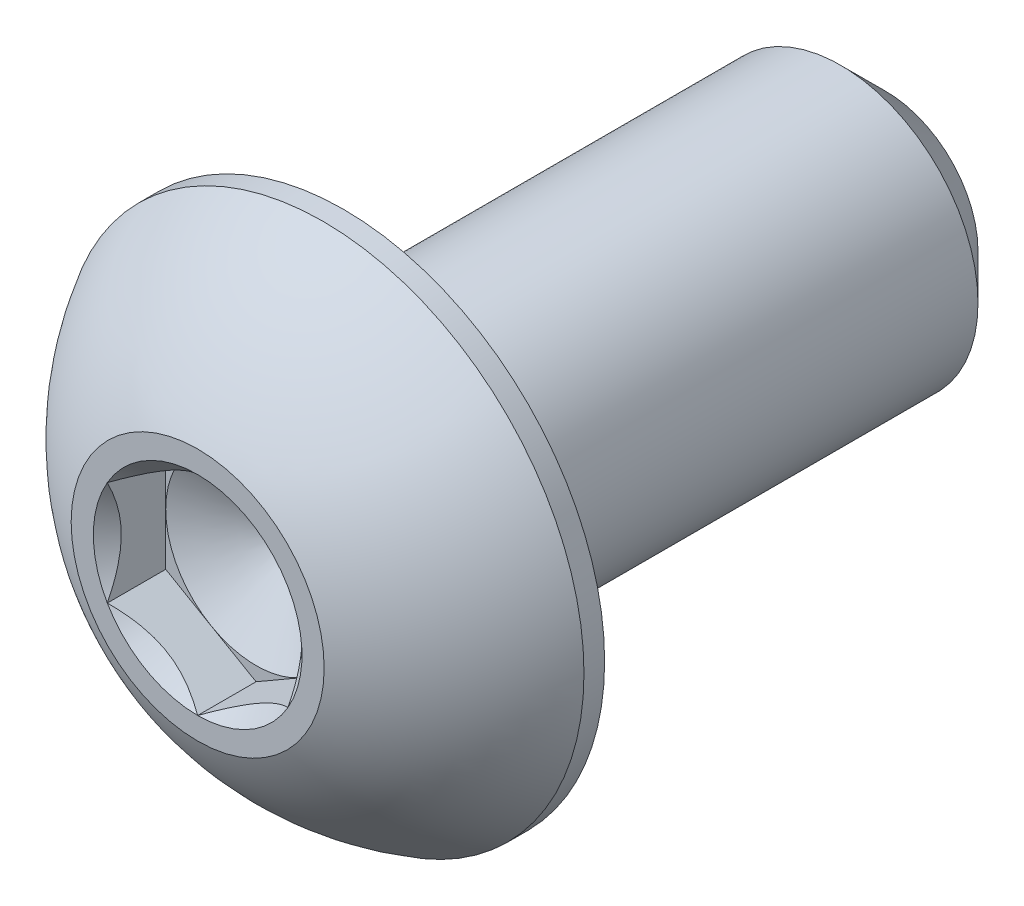
ISO-10303-21;
HEADER;
FILE_DESCRIPTION(('STEP AP214'),'2;1');
FILE_NAME('part.step','',(''),(''),'','','');
FILE_SCHEMA(('AUTOMOTIVE_DESIGN { 1 0 10303 214 1 1 1 1 }'));
ENDSEC;
DATA;
#1=APPLICATION_CONTEXT('core data for automotive mechanical design processes');
#2=APPLICATION_PROTOCOL_DEFINITION('international standard','automotive_design',2000,#1);
#3=PRODUCT_CONTEXT('',#1,'mechanical');
#4=PRODUCT('Part','Part','',(#3));
#5=PRODUCT_RELATED_PRODUCT_CATEGORY('part','',(#4));
#6=PRODUCT_DEFINITION_FORMATION('','',#4);
#7=PRODUCT_DEFINITION_CONTEXT('part definition',#1,'design');
#8=PRODUCT_DEFINITION('design','',#6,#7);
#9=PRODUCT_DEFINITION_SHAPE('','',#8);
#10=(LENGTH_UNIT() NAMED_UNIT(*) SI_UNIT(.MILLI.,.METRE.));
#11=(NAMED_UNIT(*) PLANE_ANGLE_UNIT() SI_UNIT($,.RADIAN.));
#12=(NAMED_UNIT(*) SI_UNIT($,.STERADIAN.) SOLID_ANGLE_UNIT());
#13=UNCERTAINTY_MEASURE_WITH_UNIT(LENGTH_MEASURE(1.E-05),#10,'distance_accuracy_value','');
#14=(GEOMETRIC_REPRESENTATION_CONTEXT(3) GLOBAL_UNCERTAINTY_ASSIGNED_CONTEXT((#13)) GLOBAL_UNIT_ASSIGNED_CONTEXT((#10,
#11,#12)) REPRESENTATION_CONTEXT('',''));
#15=CARTESIAN_POINT('',(0.,0.,0.));
#16=DIRECTION('',(0.,0.,1.));
#17=DIRECTION('',(1.,0.,0.));
#18=AXIS2_PLACEMENT_3D('',#15,#16,#17);
#19=CARTESIAN_POINT('',(0.,1.58750000000007,6.04519999999988));
#20=DIRECTION('',(0.,0.,-0.999999999999994));
#21=DIRECTION('',(-0.999999999999998,0.,0.));
#22=AXIS2_PLACEMENT_3D('',#19,#20,#21);
#23=PLANE('',#22);
#24=CARTESIAN_POINT('',(0.,0.,6.04519999999993));
#25=DIRECTION('',(0.,0.,0.999999999999994));
#26=DIRECTION('',(0.999999999999998,0.,0.));
#27=AXIS2_PLACEMENT_3D('',#24,#25,#26);
#28=CIRCLE('',#27,2.2225);
#29=CARTESIAN_POINT('',(2.2225,0.,6.04519999999994));
#30=VERTEX_POINT('',#29);
#31=EDGE_CURVE('E170',#30,#30,#28,.T.);
#32=ORIENTED_EDGE('',*,*,#31,.T.);
#33=EDGE_LOOP('',(#32));
#34=FACE_BOUND('',#33,.T.);
#35=CARTESIAN_POINT('',(0.,0.,6.04519999999993));
#36=DIRECTION('',(0.,0.,0.999999999999994));
#37=DIRECTION('',(0.999999999999998,0.,0.));
#38=AXIS2_PLACEMENT_3D('',#35,#36,#37);
#39=CIRCLE('',#38,1.83308710467706);
#40=CARTESIAN_POINT('',(-1.66533453693773E-13,1.83308710467717,6.04519999999985));
#41=VERTEX_POINT('',#40);
#42=CARTESIAN_POINT('',(-1.58750000000027,0.916543552338667,6.04519999999982));
#43=VERTEX_POINT('',#42);
#44=EDGE_CURVE('E124',#41,#43,#39,.T.);
#45=ORIENTED_EDGE('',*,*,#44,.F.);
#46=CARTESIAN_POINT('',(0.,0.,6.04519999999993));
#47=DIRECTION('',(0.,0.,0.999999999999994));
#48=DIRECTION('',(0.999999999999998,0.,0.));
#49=AXIS2_PLACEMENT_3D('',#46,#47,#48);
#50=CIRCLE('',#49,1.83308710467706);
#51=CARTESIAN_POINT('',(1.58749999999985,0.916543552338639,6.04519999999999));
#52=VERTEX_POINT('',#51);
#53=EDGE_CURVE('E109',#52,#41,#50,.T.);
#54=ORIENTED_EDGE('',*,*,#53,.F.);
#55=CARTESIAN_POINT('',(0.,0.,6.04519999999993));
#56=DIRECTION('',(0.,0.,0.999999999999994));
#57=DIRECTION('',(0.999999999999998,0.,0.));
#58=AXIS2_PLACEMENT_3D('',#55,#56,#57);
#59=CIRCLE('',#58,1.83308710467706);
#60=CARTESIAN_POINT('',(1.58749999999977,-0.916543552338556,6.04519999999996));
#61=VERTEX_POINT('',#60);
#62=EDGE_CURVE('E120',#61,#52,#59,.T.);
#63=ORIENTED_EDGE('',*,*,#62,.F.);
#64=CARTESIAN_POINT('',(0.,0.,6.04519999999993));
#65=DIRECTION('',(0.,0.,0.999999999999994));
#66=DIRECTION('',(0.999999999999998,0.,0.));
#67=AXIS2_PLACEMENT_3D('',#64,#65,#66);
#68=CIRCLE('',#67,1.83308710467706);
#69=CARTESIAN_POINT('',(-1.38777878078145E-13,-1.833087104677,6.04519999999999));
#70=VERTEX_POINT('',#69);
#71=EDGE_CURVE('E141',#70,#61,#68,.T.);
#72=ORIENTED_EDGE('',*,*,#71,.F.);
#73=CARTESIAN_POINT('',(0.,0.,6.04519999999993));
#74=DIRECTION('',(0.,0.,0.999999999999994));
#75=DIRECTION('',(0.999999999999998,0.,0.));
#76=AXIS2_PLACEMENT_3D('',#73,#74,#75);
#77=CIRCLE('',#76,1.83308710467706);
#78=CARTESIAN_POINT('',(-1.5875000000001,-0.9165435523385,6.0451999999999));
#79=VERTEX_POINT('',#78);
#80=EDGE_CURVE('E438',#79,#70,#77,.T.);
#81=ORIENTED_EDGE('',*,*,#80,.F.);
#82=CARTESIAN_POINT('',(0.,0.,6.04519999999993));
#83=DIRECTION('',(0.,0.,0.999999999999994));
#84=DIRECTION('',(0.999999999999998,0.,0.));
#85=AXIS2_PLACEMENT_3D('',#82,#83,#84);
#86=CIRCLE('',#85,1.83308710467706);
#87=EDGE_CURVE('E447',#43,#79,#86,.T.);
#88=ORIENTED_EDGE('',*,*,#87,.F.);
#89=EDGE_LOOP('',(#45,#54,#63,#72,#81,#88));
#90=FACE_BOUND('',#89,.T.);
#91=ADVANCED_FACE('F36',(#34,#90),#23,.F.);
#92=CARTESIAN_POINT('',(0.,0.,-6.0452));
#93=DIRECTION('',(0.,0.,0.999999999999994));
#94=DIRECTION('',(0.999999999999998,0.,0.));
#95=AXIS2_PLACEMENT_3D('',#92,#93,#94);
#96=CONICAL_SURFACE('',#95,1.61925,0.785398163397445);
#97=CARTESIAN_POINT('',(0.,0.,-5.25144999999996));
#98=DIRECTION('',(0.,0.,0.999999999999994));
#99=DIRECTION('',(0.999999999999998,0.,0.));
#100=AXIS2_PLACEMENT_3D('',#97,#98,#99);
#101=CIRCLE('',#100,2.413);
#102=CARTESIAN_POINT('',(2.41299999999999,0.,-5.25144999999996));
#103=VERTEX_POINT('',#102);
#104=EDGE_CURVE('E11',#103,#103,#101,.T.);
#105=ORIENTED_EDGE('',*,*,#104,.F.);
#106=EDGE_LOOP('',(#105));
#107=FACE_BOUND('',#106,.T.);
#108=CARTESIAN_POINT('',(0.,0.,-6.0452));
#109=DIRECTION('',(0.,0.,0.999999999999994));
#110=DIRECTION('',(0.999999999999998,0.,0.));
#111=AXIS2_PLACEMENT_3D('',#108,#109,#110);
#112=CIRCLE('',#111,1.61925);
#113=CARTESIAN_POINT('',(1.61925,0.,-6.0452));
#114=VERTEX_POINT('',#113);
#115=EDGE_CURVE('E163',#114,#114,#112,.T.);
#116=ORIENTED_EDGE('',*,*,#115,.T.);
#117=EDGE_LOOP('',(#116));
#118=FACE_BOUND('',#117,.T.);
#119=ADVANCED_FACE('F38',(#107,#118),#96,.T.);
#120=CARTESIAN_POINT('',(0.,0.,6.04519999999993));
#121=DIRECTION('',(0.,0.,0.999999999999994));
#122=DIRECTION('',(0.999999999999998,0.,0.));
#123=AXIS2_PLACEMENT_3D('',#120,#121,#122);
#124=CYLINDRICAL_SURFACE('',#123,2.413);
#125=CARTESIAN_POINT('',(0.,0.,3.47979999999996));
#126=DIRECTION('',(0.,0.,0.999999999999994));
#127=DIRECTION('',(0.999999999999998,0.,0.));
#128=AXIS2_PLACEMENT_3D('',#125,#126,#127);
#129=CIRCLE('',#128,2.413);
#130=CARTESIAN_POINT('',(2.41299999999997,0.,3.47979999999997));
#131=VERTEX_POINT('',#130);
#132=EDGE_CURVE('E44',#131,#131,#129,.T.);
#133=ORIENTED_EDGE('',*,*,#132,.F.);
#134=EDGE_LOOP('',(#133));
#135=FACE_BOUND('',#134,.T.);
#136=ORIENTED_EDGE('',*,*,#104,.T.);
#137=EDGE_LOOP('',(#136));
#138=FACE_BOUND('',#137,.T.);
#139=ADVANCED_FACE('F184',(#135,#138),#124,.T.);
#140=CARTESIAN_POINT('',(-1.94289029309402E-13,4.58470000000016,3.47979999999988));
#141=DIRECTION('',(0.,0.,0.999999999999994));
#142=DIRECTION('',(0.999999999999998,0.,0.));
#143=AXIS2_PLACEMENT_3D('',#140,#141,#142);
#144=PLANE('',#143);
#145=CARTESIAN_POINT('',(0.,0.,3.47979999999996));
#146=DIRECTION('',(0.,0.,0.999999999999994));
#147=DIRECTION('',(0.999999999999998,0.,0.));
#148=AXIS2_PLACEMENT_3D('',#145,#146,#147);
#149=CIRCLE('',#148,4.5847);
#150=CARTESIAN_POINT('',(4.58469999999996,0.,3.47979999999998));
#151=VERTEX_POINT('',#150);
#152=EDGE_CURVE('E177',#151,#151,#149,.T.);
#153=ORIENTED_EDGE('',*,*,#152,.F.);
#154=EDGE_LOOP('',(#153));
#155=FACE_BOUND('',#154,.T.);
#156=ORIENTED_EDGE('',*,*,#132,.T.);
#157=EDGE_LOOP('',(#156));
#158=FACE_BOUND('',#157,.T.);
#159=ADVANCED_FACE('F182',(#155,#158),#144,.F.);
#160=CARTESIAN_POINT('',(0.,0.,6.04519999999993));
#161=DIRECTION('',(0.,0.,0.999999999999994));
#162=DIRECTION('',(0.999999999999998,0.,0.));
#163=AXIS2_PLACEMENT_3D('',#160,#161,#162);
#164=CYLINDRICAL_SURFACE('',#163,4.5847);
#165=CARTESIAN_POINT('',(-1.94289029309402E-13,1.38777878078145E-13,3.84265714285707));
#166=DIRECTION('',(0.,0.,0.999999999999994));
#167=DIRECTION('',(0.999999999999998,0.,0.));
#168=AXIS2_PLACEMENT_3D('',#165,#166,#167);
#169=CIRCLE('',#168,4.5847);
#170=CARTESIAN_POINT('',(4.58469999999979,1.42340905728844E-13,3.84265714285709));
#171=VERTEX_POINT('',#170);
#172=EDGE_CURVE('E174',#171,#171,#169,.T.);
#173=ORIENTED_EDGE('',*,*,#172,.F.);
#174=EDGE_LOOP('',(#173));
#175=FACE_BOUND('',#174,.T.);
#176=ORIENTED_EDGE('',*,*,#152,.T.);
#177=EDGE_LOOP('',(#176));
#178=FACE_BOUND('',#177,.T.);
#179=ADVANCED_FACE('F203',(#175,#178),#164,.T.);
#180=CARTESIAN_POINT('',(0.,0.,1.29360962579431));
#181=DIRECTION('',(0.,0.,0.999999999999994));
#182=DIRECTION('',(0.,1.,0.));
#183=AXIS2_PLACEMENT_3D('',#180,#181,#182);
#184=SPHERICAL_SURFACE('',#183,5.24567606074224);
#185=ORIENTED_EDGE('',*,*,#31,.F.);
#186=EDGE_LOOP('',(#185));
#187=FACE_BOUND('',#186,.T.);
#188=ORIENTED_EDGE('',*,*,#172,.T.);
#189=EDGE_LOOP('',(#188));
#190=FACE_BOUND('',#189,.T.);
#191=ADVANCED_FACE('F195',(#187,#190),#184,.T.);
#192=CARTESIAN_POINT('',(-2.77555756156289E-13,1.61925000000017,-6.04519999999992));
#193=DIRECTION('',(0.,0.,0.999999999999994));
#194=DIRECTION('',(0.999999999999998,0.,0.));
#195=AXIS2_PLACEMENT_3D('',#192,#193,#194);
#196=PLANE('',#195);
#197=ORIENTED_EDGE('',*,*,#115,.F.);
#198=EDGE_LOOP('',(#197));
#199=FACE_BOUND('',#198,.T.);
#200=ADVANCED_FACE('F193',(#199),#196,.F.);
#201=CARTESIAN_POINT('',(1.58749999999985,0.916543552338639,6.04519999999999));
#202=DIRECTION('',(-0.499999999999998,-0.866025403784439,0.));
#203=DIRECTION('',(0.866025403784434,-0.499999999999997,0.));
#204=AXIS2_PLACEMENT_3D('',#201,#202,#203);
#205=PLANE('',#204);
#206=CARTESIAN_POINT('',(1.58769999999983,0.916428082284731,6.0453154809637));
#207=CARTESIAN_POINT('',(1.53312479190073,0.947937093371878,6.01383080837051));
#208=CARTESIAN_POINT('',(1.47763696320959,0.97997300620348,5.98419504601342));
#209=CARTESIAN_POINT('',(1.36449087915351,1.04529792829102,5.9299322600207));
#210=CARTESIAN_POINT('',(1.30682185887048,1.07859315267533,5.90533543513306));
#211=CARTESIAN_POINT('',(1.19053497812673,1.14573141457595,5.86320036427247));
#212=CARTESIAN_POINT('',(1.1319467447439,1.17955734689087,5.84555619272971));
#213=CARTESIAN_POINT('',(1.01348022674539,1.24795402294727,5.81837147008489));
#214=CARTESIAN_POINT('',(0.953605562983705,1.28252267618772,5.80881062069505));
#215=CARTESIAN_POINT('',(0.850418771876363,1.34209759781036,5.80018441310398));
#216=CARTESIAN_POINT('',(0.807240015952097,1.3670268641665,5.79890719280953));
#217=CARTESIAN_POINT('',(0.720953038535216,1.41684467380569,5.80105705581466));
#218=CARTESIAN_POINT('',(0.677844847078434,1.44173319974755,5.80448578854931));
#219=CARTESIAN_POINT('',(0.592046335001865,1.49126899379103,5.81585099443333));
#220=CARTESIAN_POINT('',(0.549356408925249,1.51591603410305,5.82379137180163));
#221=CARTESIAN_POINT('',(0.464693063478203,1.56479643938738,5.84374841445109));
#222=CARTESIAN_POINT('',(0.422719959754912,1.58902962212073,5.85576682920866));
#223=CARTESIAN_POINT('',(0.315211458113404,1.65109968448361,5.89144689724721));
#224=CARTESIAN_POINT('',(0.25034277170876,1.68855163804135,5.91779857230313));
#225=CARTESIAN_POINT('',(0.154961599380803,1.74361998356052,5.96228353685173));
#226=CARTESIAN_POINT('',(0.12353069953604,1.76176662204677,5.97791285780117));
#227=CARTESIAN_POINT('',(0.0612469855695099,1.79772614107147,6.0105984878611));
#228=CARTESIAN_POINT('',(0.0303939039604356,1.81553917604381,6.02765411565692));
#229=CARTESIAN_POINT('',(-0.000200000000172285,1.83320257473105,6.04531548096356));
#230=B_SPLINE_CURVE_WITH_KNOTS('',3,(#206,#207,#208,#209,#210,#211,#212,#213,#214,#215,#216,
#217,#218,#219,#220,#221,#222,#223,#224,#225,#226,#227,#228,#229),.UNSPECIFIED.,.F.,.F.,(4,2,2,
2,2,2,2,2,2,2,2,4),(0.,0.211482650810855,0.42419787080734,0.633533884524897,0.842342653263452,
0.991755553727228,1.14122083674212,1.29081565918883,1.44047473906441,1.67818780869723,
1.79671410024897,1.91518409436633),.UNSPECIFIED.);
#231=EDGE_CURVE('E106',#52,#41,#230,.T.);
#232=ORIENTED_EDGE('',*,*,#231,.T.);
#233=DIRECTION('',(0.,0.,-0.999999999999994));
#234=VECTOR('',#233,1.);
#235=CARTESIAN_POINT('',(-1.66533453693773E-13,1.83308710467717,6.04519999999985));
#236=LINE('',#235,#234);
#237=CARTESIAN_POINT('',(-1.94289029309402E-13,1.83308710467721,5.01903999999977));
#238=VERTEX_POINT('',#237);
#239=EDGE_CURVE('E161',#41,#238,#236,.T.);
#240=ORIENTED_EDGE('',*,*,#239,.T.);
#241=DIRECTION('',(-0.866025403784434,0.499999999999997,0.));
#242=VECTOR('',#241,1.);
#243=CARTESIAN_POINT('',(1.58749999999974,0.916543552338653,5.01903999999991));
#244=LINE('',#243,#242);
#245=CARTESIAN_POINT('',(0.793749999999843,1.37481532850799,5.01903999999993));
#246=VERTEX_POINT('',#245);
#247=EDGE_CURVE('E474',#246,#238,#244,.T.);
#248=ORIENTED_EDGE('',*,*,#247,.F.);
#249=CARTESIAN_POINT('',(1.58749999999974,0.916543552338653,5.01903999999991));
#250=VERTEX_POINT('',#249);
#251=EDGE_CURVE('E51',#250,#246,#244,.T.);
#252=ORIENTED_EDGE('',*,*,#251,.F.);
#253=DIRECTION('',(0.,0.,-0.999999999999994));
#254=VECTOR('',#253,1.);
#255=CARTESIAN_POINT('',(1.58749999999985,0.916543552338639,6.04519999999999));
#256=LINE('',#255,#254);
#257=EDGE_CURVE('E137',#52,#250,#256,.T.);
#258=ORIENTED_EDGE('',*,*,#257,.F.);
#259=EDGE_LOOP('',(#232,#240,#248,#252,#258));
#260=FACE_BOUND('',#259,.T.);
#261=ADVANCED_FACE('F143',(#260),#205,.T.);
#262=CARTESIAN_POINT('',(-1.66533453693773E-13,1.83308710467717,6.04519999999985));
#263=DIRECTION('',(0.499999999999997,-0.866025403784438,0.));
#264=DIRECTION('',(0.866025403784437,0.500000000000001,0.));
#265=AXIS2_PLACEMENT_3D('',#262,#263,#264);
#266=PLANE('',#265);
#267=CARTESIAN_POINT('',(0.000199999999922484,1.83320257473099,6.04531548096367));
#268=CARTESIAN_POINT('',(-0.0543752080992611,1.8016935636439,6.01383080837063));
#269=CARTESIAN_POINT('',(-0.109863036790426,1.76965765081232,5.98419504601359));
#270=CARTESIAN_POINT('',(-0.223009120846511,1.70433272872479,5.9299322600209));
#271=CARTESIAN_POINT('',(-0.280678141129537,1.67103750434047,5.90533543513324));
#272=CARTESIAN_POINT('',(-0.39696502187329,1.60389924243987,5.86320036427266));
#273=CARTESIAN_POINT('',(-0.455553255256144,1.57007331012497,5.84555619272994));
#274=CARTESIAN_POINT('',(-0.5740197732546,1.5016766340685,5.81837147008502));
#275=CARTESIAN_POINT('',(-0.633894437016204,1.46710798082797,5.80881062069502));
#276=CARTESIAN_POINT('',(-0.737081228123542,1.40753305920538,5.800184413104));
#277=CARTESIAN_POINT('',(-0.780259984047845,1.38260379284931,5.79890719280966));
#278=CARTESIAN_POINT('',(-0.866546961464744,1.33278598321018,5.80105705581485));
#279=CARTESIAN_POINT('',(-0.909655152921509,1.3078974572683,5.80448578854946));
#280=CARTESIAN_POINT('',(-0.995453664998067,1.25836166322483,5.81585099443346));
#281=CARTESIAN_POINT('',(-1.03814359107469,1.23371462291284,5.82379137180178));
#282=CARTESIAN_POINT('',(-1.12280693652171,1.18483421762845,5.84374841445118));
#283=CARTESIAN_POINT('',(-1.16478004024496,1.16060103489501,5.85576682920868));
#284=CARTESIAN_POINT('',(-1.27228854188645,1.09853097253207,5.89144689724718));
#285=CARTESIAN_POINT('',(-1.33715722829116,1.06107901897447,5.91779857230319));
#286=CARTESIAN_POINT('',(-1.43253840061916,1.00601067345534,5.96228353685182));
#287=CARTESIAN_POINT('',(-1.46396930046393,0.987864034969089,5.97791285780125));
#288=CARTESIAN_POINT('',(-1.52625301443046,0.951904515944341,6.01059848786118));
#289=CARTESIAN_POINT('',(-1.55710609603952,0.934091480971975,6.027654115657));
#290=CARTESIAN_POINT('',(-1.58770000000011,0.916428082284704,6.04531548096367));
#291=B_SPLINE_CURVE_WITH_KNOTS('',3,(#267,#268,#269,#270,#271,#272,#273,#274,#275,#276,#277,
#278,#279,#280,#281,#282,#283,#284,#285,#286,#287,#288,#289,#290),.UNSPECIFIED.,.F.,.F.,(4,2,2,
2,2,2,2,2,2,2,2,4),(0.,0.211482650810803,0.424197870807304,0.633533884524863,0.842342653263385,
0.991755553727131,1.14122083674201,1.2908156591887,1.44047473906426,1.67818780869713,
1.79671410024889,1.91518409436627),.UNSPECIFIED.);
#292=EDGE_CURVE('E462',#41,#43,#291,.T.);
#293=ORIENTED_EDGE('',*,*,#292,.T.);
#294=DIRECTION('',(0.,0.,-0.999999999999994));
#295=VECTOR('',#294,1.);
#296=CARTESIAN_POINT('',(-1.58750000000027,0.916543552338667,6.04519999999982));
#297=LINE('',#296,#295);
#298=CARTESIAN_POINT('',(-1.58750000000024,0.916543552338778,5.01903999999982));
#299=VERTEX_POINT('',#298);
#300=EDGE_CURVE('E158',#43,#299,#297,.T.);
#301=ORIENTED_EDGE('',*,*,#300,.T.);
#302=DIRECTION('',(-0.866025403784437,-0.500000000000001,0.));
#303=VECTOR('',#302,1.);
#304=CARTESIAN_POINT('',(-1.94289029309402E-13,1.83308710467721,5.01903999999977));
#305=LINE('',#304,#303);
#306=CARTESIAN_POINT('',(-0.793750000000426,1.37481532850799,5.01903999999993));
#307=VERTEX_POINT('',#306);
#308=EDGE_CURVE('E476',#307,#299,#305,.T.);
#309=ORIENTED_EDGE('',*,*,#308,.F.);
#310=EDGE_CURVE('E477',#238,#307,#305,.T.);
#311=ORIENTED_EDGE('',*,*,#310,.F.);
#312=ORIENTED_EDGE('',*,*,#239,.F.);
#313=EDGE_LOOP('',(#293,#301,#309,#311,#312));
#314=FACE_BOUND('',#313,.T.);
#315=ADVANCED_FACE('F201',(#314),#266,.T.);
#316=CARTESIAN_POINT('',(-1.58750000000027,0.916543552338667,6.04519999999982));
#317=DIRECTION('',(0.999999999999998,0.,0.));
#318=DIRECTION('',(0.,0.,-0.999999999999994));
#319=AXIS2_PLACEMENT_3D('',#316,#317,#318);
#320=PLANE('',#319);
#321=CARTESIAN_POINT('',(-1.5875000000003,-1.80645042689193,6.61698698658385));
#322=CARTESIAN_POINT('',(-1.58750000000028,-1.76236619946985,6.58387765189207));
#323=CARTESIAN_POINT('',(-1.58750000000027,-1.71803401722439,6.55109936728736));
#324=CARTESIAN_POINT('',(-1.58750000000027,-1.62877387436161,6.48634092729781));
#325=CARTESIAN_POINT('',(-1.58750000000027,-1.58384576476267,6.45436097748321));
#326=CARTESIAN_POINT('',(-1.58750000000027,-1.44736053267693,6.35936696154791));
#327=CARTESIAN_POINT('',(-1.58750000000025,-1.3547728804757,6.29780882424475));
#328=CARTESIAN_POINT('',(-1.58750000000028,-1.16075761948649,6.17715751972012));
#329=CARTESIAN_POINT('',(-1.58750000000033,-1.05912459725123,6.11839084409815));
#330=CARTESIAN_POINT('',(-1.5875000000002,-0.850810108093185,6.01103067812025));
#331=CARTESIAN_POINT('',(-1.58750000000002,-0.744147188151308,5.96240292542404));
#332=CARTESIAN_POINT('',(-1.58750000000014,-0.583837187922957,5.90291807950616));
#333=CARTESIAN_POINT('',(-1.58750000000023,-0.532518160842241,5.88581011476269));
#334=CARTESIAN_POINT('',(-1.5875000000003,-0.428659985513726,5.8557170530759));
#335=CARTESIAN_POINT('',(-1.58750000000028,-0.376120751676435,5.84273224628803));
#336=CARTESIAN_POINT('',(-1.58750000000026,-0.27100369810843,5.82177039746287));
#337=CARTESIAN_POINT('',(-1.58750000000026,-0.218442994151775,5.81370885122087));
#338=CARTESIAN_POINT('',(-1.58750000000027,-0.112783135871231,5.80274746810404));
#339=CARTESIAN_POINT('',(-1.58750000000027,-0.0596840710481443,5.79984678695649));
#340=CARTESIAN_POINT('',(-1.58750000000027,0.0447055832561276,5.79941381931856));
#341=CARTESIAN_POINT('',(-1.58750000000027,0.0959954901562707,5.80170012793693));
#342=CARTESIAN_POINT('',(-1.58750000000027,0.198125185705364,5.81111970580175));
#343=CARTESIAN_POINT('',(-1.58750000000027,0.248964929488588,5.81825345278285));
#344=CARTESIAN_POINT('',(-1.58750000000027,0.350686556652219,5.8371031096996));
#345=CARTESIAN_POINT('',(-1.58750000000027,0.401553911407961,5.84889626149526));
#346=CARTESIAN_POINT('',(-1.58750000000027,0.502179810539587,5.87644443755652));
#347=CARTESIAN_POINT('',(-1.58750000000027,0.551938454553221,5.89219910423221));
#348=CARTESIAN_POINT('',(-1.58750000000027,0.709597941546914,5.94801737605607));
#349=CARTESIAN_POINT('',(-1.58750000000027,0.815228306930224,5.99447915633843));
#350=CARTESIAN_POINT('',(-1.58750000000027,1.0215173517048,6.09775145508559));
#351=CARTESIAN_POINT('',(-1.58750000000027,1.12215634479545,6.15459935808182));
#352=CARTESIAN_POINT('',(-1.58750000000027,1.31447644029513,6.27184912470752));
#353=CARTESIAN_POINT('',(-1.58750000000026,1.40635401847366,6.33193268451356));
#354=CARTESIAN_POINT('',(-1.58750000000027,1.54171769329402,6.42480190804494));
#355=CARTESIAN_POINT('',(-1.58750000000028,1.58625419266996,6.4560831278699));
#356=CARTESIAN_POINT('',(-1.58750000000026,1.67471932537725,6.51946920360782));
#357=CARTESIAN_POINT('',(-1.58750000000023,1.71864812234289,6.55157383088697));
#358=CARTESIAN_POINT('',(-1.58750000000016,1.76232404534835,6.58401978447597));
#359=B_SPLINE_CURVE_WITH_KNOTS('',3,(#321,#322,#323,#324,#325,#326,#327,#328,#329,#330,#331,
#332,#333,#334,#335,#336,#337,#338,#339,#340,#341,#342,#343,#344,#345,#346,#347,#348,#349,#350,
#351,#352,#353,#354,#355,#356,#357,#358),.UNSPECIFIED.,.F.,.F.,(4,2,2,2,2,2,2,2,2,2,2,2,2,2,2,2,
2,2,4),(0.,0.165394720611731,0.330831599805528,0.664230904656233,1.0161364276987,
1.36683276443435,1.52898157466773,1.69114179313286,1.85043410106579,2.00970034776328,
2.16348276168536,2.31728033368469,2.47374234648066,2.63019024115089,2.97536284656872,
3.32180328575191,3.65097853196632,3.8142455159314,3.97746764647546),.UNSPECIFIED.);
#360=EDGE_CURVE('E455',#43,#79,#359,.F.);
#361=ORIENTED_EDGE('',*,*,#360,.T.);
#362=DIRECTION('',(0.,0.,-0.999999999999994));
#363=VECTOR('',#362,1.);
#364=CARTESIAN_POINT('',(-1.5875000000001,-0.9165435523385,6.0451999999999));
#365=LINE('',#364,#363);
#366=CARTESIAN_POINT('',(-1.5875000000001,-0.916543552338486,5.01903999999999));
#367=VERTEX_POINT('',#366);
#368=EDGE_CURVE('E155',#79,#367,#365,.T.);
#369=ORIENTED_EDGE('',*,*,#368,.T.);
#370=DIRECTION('',(0.,-1.,0.));
#371=VECTOR('',#370,1.);
#372=CARTESIAN_POINT('',(-1.58750000000024,0.916543552338778,5.01903999999982));
#373=LINE('',#372,#371);
#374=CARTESIAN_POINT('',(-1.58750000000041,1.94289029309402E-13,5.01903999999991));
#375=VERTEX_POINT('',#374);
#376=EDGE_CURVE('E480',#375,#367,#373,.T.);
#377=ORIENTED_EDGE('',*,*,#376,.F.);
#378=EDGE_CURVE('E481',#299,#375,#373,.T.);
#379=ORIENTED_EDGE('',*,*,#378,.F.);
#380=ORIENTED_EDGE('',*,*,#300,.F.);
#381=EDGE_LOOP('',(#361,#369,#377,#379,#380));
#382=FACE_BOUND('',#381,.T.);
#383=ADVANCED_FACE('F254',(#382),#320,.T.);
#384=CARTESIAN_POINT('',(-1.5875000000001,-0.9165435523385,6.0451999999999));
#385=DIRECTION('',(0.499999999999998,0.866025403784439,0.));
#386=DIRECTION('',(-0.866025403784435,0.499999999999998,0.));
#387=AXIS2_PLACEMENT_3D('',#384,#385,#386);
#388=PLANE('',#387);
#389=CARTESIAN_POINT('',(-1.5877000000003,-0.916428082284523,6.04531548096356));
#390=CARTESIAN_POINT('',(-1.53312479190112,-0.947937093371687,6.01383080837059));
#391=CARTESIAN_POINT('',(-1.47763696320995,-0.979973006203285,5.98419504601358));
#392=CARTESIAN_POINT('',(-1.36449087915387,-1.04529792829081,5.9299322600209));
#393=CARTESIAN_POINT('',(-1.30682185887085,-1.07859315267511,5.90533543513323));
#394=CARTESIAN_POINT('',(-1.19053497812712,-1.14573141457574,5.8632003642726));
#395=CARTESIAN_POINT('',(-1.13194674474428,-1.17955734689068,5.84555619272982));
#396=CARTESIAN_POINT('',(-1.01348022674573,-1.24795402294706,5.81837147008495));
#397=CARTESIAN_POINT('',(-0.953605562984013,-1.28252267618746,5.80881062069506));
#398=CARTESIAN_POINT('',(-0.850418771876682,-1.34209759781011,5.80018441310398));
#399=CARTESIAN_POINT('',(-0.807240015952446,-1.36702686416629,5.79890719280953));
#400=CARTESIAN_POINT('',(-0.720953038535594,-1.4168446738055,5.80105705581464));
#401=CARTESIAN_POINT('',(-0.677844847078811,-1.44173319974734,5.80448578854927));
#402=CARTESIAN_POINT('',(-0.592046335002256,-1.4912689937908,5.81585099443327));
#403=CARTESIAN_POINT('',(-0.549356408925655,-1.51591603410282,5.82379137180157));
#404=CARTESIAN_POINT('',(-0.464693063478618,-1.56479643938715,5.84374841445096));
#405=CARTESIAN_POINT('',(-0.422719959755321,-1.58902962212048,5.85576682920846));
#406=CARTESIAN_POINT('',(-0.31521145811382,-1.65109968448336,5.89144689724695));
#407=CARTESIAN_POINT('',(-0.250342771709208,-1.68855163804109,5.91779857230293));
#408=CARTESIAN_POINT('',(-0.154961599381251,-1.74361998356027,5.96228353685151));
#409=CARTESIAN_POINT('',(-0.123530699536477,-1.76176662204652,5.97791285780092));
#410=CARTESIAN_POINT('',(-0.0612469855699508,-1.79772614107122,6.01059848786088));
#411=CARTESIAN_POINT('',(-0.0303939039608903,-1.81553917604353,6.02765411565675));
#412=CARTESIAN_POINT('',(0.000199999999672684,-1.83320257473071,6.04531548096353));
#413=B_SPLINE_CURVE_WITH_KNOTS('',3,(#389,#390,#391,#392,#393,#394,#395,#396,#397,#398,#399,
#400,#401,#402,#403,#404,#405,#406,#407,#408,#409,#410,#411,#412),.UNSPECIFIED.,.F.,.F.,(4,2,2,
2,2,2,2,2,2,2,2,4),(0.,0.211482650810808,0.424197870807276,0.633533884524882,0.842342653263472,
0.99175555372722,1.14122083674209,1.29081565918876,1.4404747390643,1.67818780869709,
1.79671410024883,1.9151840943662),.UNSPECIFIED.);
#414=EDGE_CURVE('E440',#79,#70,#413,.T.);
#415=ORIENTED_EDGE('',*,*,#414,.T.);
#416=DIRECTION('',(0.,0.,-0.999999999999994));
#417=VECTOR('',#416,1.);
#418=CARTESIAN_POINT('',(-1.38777878078145E-13,-1.833087104677,6.04519999999999));
#419=LINE('',#418,#417);
#420=CARTESIAN_POINT('',(0.,-1.83308710467703,5.01903999999988));
#421=VERTEX_POINT('',#420);
#422=EDGE_CURVE('E146',#70,#421,#419,.T.);
#423=ORIENTED_EDGE('',*,*,#422,.T.);
#424=DIRECTION('',(0.866025403784435,-0.499999999999998,0.));
#425=VECTOR('',#424,1.);
#426=CARTESIAN_POINT('',(-1.5875000000001,-0.916543552338486,5.01903999999999));
#427=LINE('',#426,#425);
#428=CARTESIAN_POINT('',(-0.793750000000343,-1.37481532850769,5.01903999999985));
#429=VERTEX_POINT('',#428);
#430=EDGE_CURVE('E484',#429,#421,#427,.T.);
#431=ORIENTED_EDGE('',*,*,#430,.F.);
#432=EDGE_CURVE('E485',#367,#429,#427,.T.);
#433=ORIENTED_EDGE('',*,*,#432,.F.);
#434=ORIENTED_EDGE('',*,*,#368,.F.);
#435=EDGE_LOOP('',(#415,#423,#431,#433,#434));
#436=FACE_BOUND('',#435,.T.);
#437=ADVANCED_FACE('F264',(#436),#388,.T.);
#438=CARTESIAN_POINT('',(-1.38777878078145E-13,-1.833087104677,6.04519999999999));
#439=DIRECTION('',(-0.499999999999997,0.866025403784438,0.));
#440=DIRECTION('',(-0.866025403784437,-0.500000000000001,0.));
#441=AXIS2_PLACEMENT_3D('',#438,#439,#440);
#442=PLANE('',#441);
#443=CARTESIAN_POINT('',(-0.000200000000227796,-1.8332025747308,6.04531548096356));
#444=CARTESIAN_POINT('',(0.054375208098946,-1.80169356364372,6.01383080837045));
#445=CARTESIAN_POINT('',(0.109863036790116,-1.76965765081215,5.98419504601339));
#446=CARTESIAN_POINT('',(0.22300912084619,-1.70433272872464,5.9299322600207));
#447=CARTESIAN_POINT('',(0.2806781411292,-1.67103750434033,5.90533543513305));
#448=CARTESIAN_POINT('',(0.396965021872912,-1.60389924243973,5.86320036427242));
#449=CARTESIAN_POINT('',(0.455553255255742,-1.57007331012482,5.84555619272963));
#450=CARTESIAN_POINT('',(0.574019773254246,-1.50167663406841,5.81837147008483));
#451=CARTESIAN_POINT('',(0.633894437015923,-1.46710798082794,5.80881062069502));
#452=CARTESIAN_POINT('',(0.737081228123276,-1.40753305920531,5.80018441310391));
#453=CARTESIAN_POINT('',(0.780259984047555,-1.38260379284917,5.7989071928094));
#454=CARTESIAN_POINT('',(0.866546961464444,-1.33278598320998,5.80105705581448));
#455=CARTESIAN_POINT('',(0.909655152921222,-1.30789745726811,5.80448578854914));
#456=CARTESIAN_POINT('',(0.995453664997816,-1.25836166322465,5.81585099443314));
#457=CARTESIAN_POINT('',(1.03814359107446,-1.23371462291266,5.82379137180141));
#458=CARTESIAN_POINT('',(1.12280693652145,-1.18483421762823,5.8437484144509));
#459=CARTESIAN_POINT('',(1.16478004024465,-1.16060103489475,5.85576682920854));
#460=CARTESIAN_POINT('',(1.27228854188613,-1.09853097253177,5.89144689724713));
#461=CARTESIAN_POINT('',(1.33715722829095,-1.06107901897423,5.91779857230295));
#462=CARTESIAN_POINT('',(1.43253840061901,-1.0060106734551,5.96228353685149));
#463=CARTESIAN_POINT('',(1.46396930046378,-0.987864034968832,5.97791285780093));
#464=CARTESIAN_POINT('',(1.5262530144303,-0.951904515944096,6.01059848786094));
#465=CARTESIAN_POINT('',(1.55710609603935,-0.934091480971755,6.02765411565685));
#466=CARTESIAN_POINT('',(1.58769999999991,-0.916428082284565,6.04531548096364));
#467=B_SPLINE_CURVE_WITH_KNOTS('',3,(#443,#444,#445,#446,#447,#448,#449,#450,#451,#452,#453,
#454,#455,#456,#457,#458,#459,#460,#461,#462,#463,#464,#465,#466),.UNSPECIFIED.,.F.,.F.,(4,2,2,
2,2,2,2,2,2,2,2,4),(0.,0.211482650810831,0.424197870807268,0.633533884524813,0.842342653263369,
0.991755553727169,1.14122083674207,1.29081565918879,1.44047473906439,1.67818780869729,
1.79671410024907,1.91518409436648),.UNSPECIFIED.);
#468=EDGE_CURVE('E431',#70,#61,#467,.T.);
#469=ORIENTED_EDGE('',*,*,#468,.T.);
#470=DIRECTION('',(0.,0.,-0.999999999999994));
#471=VECTOR('',#470,1.);
#472=CARTESIAN_POINT('',(1.58749999999977,-0.916543552338556,6.04519999999996));
#473=LINE('',#472,#471);
#474=CARTESIAN_POINT('',(1.58749999999977,-0.916543552338334,5.01903999999982));
#475=VERTEX_POINT('',#474);
#476=EDGE_CURVE('E140',#61,#475,#473,.T.);
#477=ORIENTED_EDGE('',*,*,#476,.T.);
#478=DIRECTION('',(0.866025403784437,0.500000000000001,0.));
#479=VECTOR('',#478,1.);
#480=CARTESIAN_POINT('',(0.,-1.83308710467703,5.01903999999988));
#481=LINE('',#480,#479);
#482=CARTESIAN_POINT('',(0.793749999999982,-1.37481532850781,5.01903999999999));
#483=VERTEX_POINT('',#482);
#484=EDGE_CURVE('E487',#483,#475,#481,.T.);
#485=ORIENTED_EDGE('',*,*,#484,.F.);
#486=EDGE_CURVE('E488',#421,#483,#481,.T.);
#487=ORIENTED_EDGE('',*,*,#486,.F.);
#488=ORIENTED_EDGE('',*,*,#422,.F.);
#489=EDGE_LOOP('',(#469,#477,#485,#487,#488));
#490=FACE_BOUND('',#489,.T.);
#491=ADVANCED_FACE('F274',(#490),#442,.T.);
#492=CARTESIAN_POINT('',(1.58749999999977,-0.916543552338556,6.04519999999996));
#493=DIRECTION('',(-0.999999999999995,0.,0.));
#494=DIRECTION('',(0.,-1.,0.));
#495=AXIS2_PLACEMENT_3D('',#492,#493,#494);
#496=PLANE('',#495);
#497=CARTESIAN_POINT('',(1.58749999999977,-1.80645042689198,6.61698698658379));
#498=CARTESIAN_POINT('',(1.58749999999977,-1.76236619946996,6.5838776518919));
#499=CARTESIAN_POINT('',(1.58749999999977,-1.71803401722452,6.55109936728714));
#500=CARTESIAN_POINT('',(1.58749999999977,-1.62877387436174,6.48634092729752));
#501=CARTESIAN_POINT('',(1.58749999999977,-1.58384576476278,6.45436097748291));
#502=CARTESIAN_POINT('',(1.58749999999977,-1.44736053267704,6.35936696154763));
#503=CARTESIAN_POINT('',(1.58749999999977,-1.35477288047583,6.29780882424449));
#504=CARTESIAN_POINT('',(1.58749999999977,-1.16075761948668,6.17715751971977));
#505=CARTESIAN_POINT('',(1.58749999999977,-1.05912459725147,6.11839084409769));
#506=CARTESIAN_POINT('',(1.58749999999977,-0.850810108093299,6.01103067812002));
#507=CARTESIAN_POINT('',(1.58749999999977,-0.74414718815125,5.96240292542413));
#508=CARTESIAN_POINT('',(1.58749999999977,-0.58383718792292,5.90291807950595));
#509=CARTESIAN_POINT('',(1.58749999999977,-0.532518160842249,5.88581011476228));
#510=CARTESIAN_POINT('',(1.58749999999977,-0.428659985513756,5.85571705307535));
#511=CARTESIAN_POINT('',(1.58749999999976,-0.376120751676444,5.84273224628755));
#512=CARTESIAN_POINT('',(1.58749999999978,-0.271003698108422,5.82177039746235));
#513=CARTESIAN_POINT('',(1.5874999999998,-0.218442994151772,5.81370885122024));
#514=CARTESIAN_POINT('',(1.58749999999974,-0.112783135871195,5.80274746810365));
#515=CARTESIAN_POINT('',(1.58749999999966,-0.0596840710480702,5.79984678695646));
#516=CARTESIAN_POINT('',(1.58749999999966,0.0447055832562571,5.79941381931852));
#517=CARTESIAN_POINT('',(1.58749999999974,0.0959954901564177,5.80170012793655));
#518=CARTESIAN_POINT('',(1.5874999999998,0.198125185705504,5.81111970580114));
#519=CARTESIAN_POINT('',(1.58749999999978,0.248964929488703,5.81825345278236));
#520=CARTESIAN_POINT('',(1.58749999999976,0.350686556652322,5.83710310969913));
#521=CARTESIAN_POINT('',(1.58749999999976,0.401553911408078,5.84889626149468));
#522=CARTESIAN_POINT('',(1.58749999999977,0.50217981053962,5.87644443755616));
#523=CARTESIAN_POINT('',(1.58749999999979,0.551938454553157,5.89219910423217));
#524=CARTESIAN_POINT('',(1.58749999999981,0.709597941546781,5.94801737605651));
#525=CARTESIAN_POINT('',(1.58749999999978,0.815228306930364,5.9944791563383));
#526=CARTESIAN_POINT('',(1.58749999999975,1.02151735170514,6.09775145508506));
#527=CARTESIAN_POINT('',(1.58749999999976,1.12215634479571,6.15459935808147));
#528=CARTESIAN_POINT('',(1.58749999999976,1.31447644029529,6.2718491247073));
#529=CARTESIAN_POINT('',(1.58749999999976,1.40635401847379,6.33193268451331));
#530=CARTESIAN_POINT('',(1.58749999999976,1.54171769329416,6.42480190804463));
#531=CARTESIAN_POINT('',(1.58749999999977,1.58625419267013,6.45608312786959));
#532=CARTESIAN_POINT('',(1.58749999999976,1.6747193253774,6.51946920360762));
#533=CARTESIAN_POINT('',(1.58749999999974,1.718648122343,6.55157383088688));
#534=CARTESIAN_POINT('',(1.58749999999971,1.76232404534832,6.58401978447611));
#535=B_SPLINE_CURVE_WITH_KNOTS('',3,(#497,#498,#499,#500,#501,#502,#503,#504,#505,#506,#507,
#508,#509,#510,#511,#512,#513,#514,#515,#516,#517,#518,#519,#520,#521,#522,#523,#524,#525,#526,
#527,#528,#529,#530,#531,#532,#533,#534),.UNSPECIFIED.,.F.,.F.,(4,2,2,2,2,2,2,2,2,2,2,2,2,2,2,2,
2,2,4),(0.,0.165394720611792,0.33083159980564,0.66423090465628,1.01613642769875,
1.36683276443452,1.52898157466797,1.69114179313311,1.85043410106605,2.00970034776362,
2.16348276168573,2.31728033368501,2.47374234648094,2.63019024115119,2.97536284656918,
3.32180328575236,3.65097853196665,3.81424551593179,3.97746764647594),.UNSPECIFIED.);
#536=EDGE_CURVE('E130',#61,#52,#535,.T.);
#537=ORIENTED_EDGE('',*,*,#536,.T.);
#538=ORIENTED_EDGE('',*,*,#257,.T.);
#539=DIRECTION('',(0.,1.,0.));
#540=VECTOR('',#539,1.);
#541=CARTESIAN_POINT('',(1.58749999999977,-0.916543552338334,5.01903999999982));
#542=LINE('',#541,#540);
#543=CARTESIAN_POINT('',(1.58749999999971,2.08166817117217E-13,5.01903999999988));
#544=VERTEX_POINT('',#543);
#545=EDGE_CURVE('E149',#544,#250,#542,.T.);
#546=ORIENTED_EDGE('',*,*,#545,.F.);
#547=EDGE_CURVE('E144',#475,#544,#542,.T.);
#548=ORIENTED_EDGE('',*,*,#547,.F.);
#549=ORIENTED_EDGE('',*,*,#476,.F.);
#550=EDGE_LOOP('',(#537,#538,#546,#548,#549));
#551=FACE_BOUND('',#550,.T.);
#552=ADVANCED_FACE('F135',(#551),#496,.T.);
#553=CARTESIAN_POINT('',(0.,0.,5.01903999999999));
#554=DIRECTION('',(0.,0.,0.999999999999994));
#555=DIRECTION('',(0.999999999999998,0.,0.));
#556=AXIS2_PLACEMENT_3D('',#553,#554,#555);
#557=PLANE('',#556);
#558=CARTESIAN_POINT('',(0.,0.,5.01903999999999));
#559=DIRECTION('',(0.,0.,0.999999999999994));
#560=DIRECTION('',(0.999999999999998,0.,0.));
#561=AXIS2_PLACEMENT_3D('',#558,#559,#560);
#562=CIRCLE('',#561,1.5875);
#563=EDGE_CURVE('E166',#483,#544,#562,.T.);
#564=ORIENTED_EDGE('',*,*,#563,.F.);
#565=ORIENTED_EDGE('',*,*,#484,.T.);
#566=ORIENTED_EDGE('',*,*,#547,.T.);
#567=EDGE_LOOP('',(#564,#565,#566));
#568=FACE_BOUND('',#567,.T.);
#569=ADVANCED_FACE('F293',(#568),#557,.T.);
#570=EDGE_CURVE('E500',#429,#483,#562,.T.);
#571=ORIENTED_EDGE('',*,*,#570,.F.);
#572=ORIENTED_EDGE('',*,*,#430,.T.);
#573=ORIENTED_EDGE('',*,*,#486,.T.);
#574=EDGE_LOOP('',(#571,#572,#573));
#575=FACE_BOUND('',#574,.T.);
#576=ADVANCED_FACE('F302',(#575),#557,.T.);
#577=EDGE_CURVE('E501',#375,#429,#562,.T.);
#578=ORIENTED_EDGE('',*,*,#577,.F.);
#579=ORIENTED_EDGE('',*,*,#376,.T.);
#580=ORIENTED_EDGE('',*,*,#432,.T.);
#581=EDGE_LOOP('',(#578,#579,#580));
#582=FACE_BOUND('',#581,.T.);
#583=ADVANCED_FACE('F313',(#582),#557,.T.);
#584=EDGE_CURVE('E502',#307,#375,#562,.T.);
#585=ORIENTED_EDGE('',*,*,#584,.F.);
#586=ORIENTED_EDGE('',*,*,#308,.T.);
#587=ORIENTED_EDGE('',*,*,#378,.T.);
#588=EDGE_LOOP('',(#585,#586,#587));
#589=FACE_BOUND('',#588,.T.);
#590=ADVANCED_FACE('F322',(#589),#557,.T.);
#591=EDGE_CURVE('E171',#246,#307,#562,.T.);
#592=ORIENTED_EDGE('',*,*,#591,.F.);
#593=ORIENTED_EDGE('',*,*,#247,.T.);
#594=ORIENTED_EDGE('',*,*,#310,.T.);
#595=EDGE_LOOP('',(#592,#593,#594));
#596=FACE_BOUND('',#595,.T.);
#597=ADVANCED_FACE('F331',(#596),#557,.T.);
#598=EDGE_CURVE('E167',#544,#246,#562,.T.);
#599=ORIENTED_EDGE('',*,*,#598,.F.);
#600=ORIENTED_EDGE('',*,*,#545,.T.);
#601=ORIENTED_EDGE('',*,*,#251,.T.);
#602=EDGE_LOOP('',(#599,#600,#601));
#603=FACE_BOUND('',#602,.T.);
#604=ADVANCED_FACE('F305',(#603),#557,.T.);
#605=CARTESIAN_POINT('',(0.,0.,5.01903999999999));
#606=DIRECTION('',(0.,0.,0.999999999999994));
#607=DIRECTION('',(0.999999999999998,0.,0.));
#608=AXIS2_PLACEMENT_3D('',#605,#606,#607);
#609=CONICAL_SURFACE('',#608,1.5875,1.0471975511966);
#610=CARTESIAN_POINT('',(0.,0.,4.10249644766143));
#611=VERTEX_POINT('',#610);
#612=VERTEX_LOOP('',#611);
#613=FACE_BOUND('',#612,.T.);
#614=ORIENTED_EDGE('',*,*,#598,.T.);
#615=ORIENTED_EDGE('',*,*,#591,.T.);
#616=ORIENTED_EDGE('',*,*,#584,.T.);
#617=ORIENTED_EDGE('',*,*,#577,.T.);
#618=ORIENTED_EDGE('',*,*,#570,.T.);
#619=ORIENTED_EDGE('',*,*,#563,.T.);
#620=EDGE_LOOP('',(#614,#615,#616,#617,#618,#619));
#621=FACE_BOUND('',#620,.T.);
#622=ADVANCED_FACE('F212',(#613,#621),#609,.F.);
#623=CARTESIAN_POINT('',(0.,0.,6.04519999999993));
#624=DIRECTION('',(0.,0.,0.999999999999994));
#625=DIRECTION('',(0.999999999999998,0.,0.));
#626=AXIS2_PLACEMENT_3D('',#623,#624,#625);
#627=CONICAL_SURFACE('',#626,1.83308710467706,0.78539816339745);
#628=ORIENTED_EDGE('',*,*,#44,.T.);
#629=ORIENTED_EDGE('',*,*,#292,.F.);
#630=EDGE_LOOP('',(#628,#629));
#631=FACE_BOUND('',#630,.T.);
#632=ADVANCED_FACE('F355',(#631),#627,.F.);
#633=CARTESIAN_POINT('',(0.,0.,6.04519999999993));
#634=DIRECTION('',(0.,0.,0.999999999999994));
#635=DIRECTION('',(0.999999999999998,0.,0.));
#636=AXIS2_PLACEMENT_3D('',#633,#634,#635);
#637=CONICAL_SURFACE('',#636,1.83308710467706,0.78539816339745);
#638=ORIENTED_EDGE('',*,*,#87,.T.);
#639=ORIENTED_EDGE('',*,*,#360,.F.);
#640=EDGE_LOOP('',(#638,#639));
#641=FACE_BOUND('',#640,.T.);
#642=ADVANCED_FACE('F362',(#641),#637,.F.);
#643=CARTESIAN_POINT('',(0.,0.,6.04519999999993));
#644=DIRECTION('',(0.,0.,0.999999999999994));
#645=DIRECTION('',(0.999999999999998,0.,0.));
#646=AXIS2_PLACEMENT_3D('',#643,#644,#645);
#647=CONICAL_SURFACE('',#646,1.83308710467706,0.78539816339745);
#648=ORIENTED_EDGE('',*,*,#80,.T.);
#649=ORIENTED_EDGE('',*,*,#414,.F.);
#650=EDGE_LOOP('',(#648,#649));
#651=FACE_BOUND('',#650,.T.);
#652=ADVANCED_FACE('F372',(#651),#647,.F.);
#653=CARTESIAN_POINT('',(0.,0.,6.04519999999993));
#654=DIRECTION('',(0.,0.,0.999999999999994));
#655=DIRECTION('',(0.999999999999998,0.,0.));
#656=AXIS2_PLACEMENT_3D('',#653,#654,#655);
#657=CONICAL_SURFACE('',#656,1.83308710467706,0.78539816339745);
#658=ORIENTED_EDGE('',*,*,#71,.T.);
#659=ORIENTED_EDGE('',*,*,#468,.F.);
#660=EDGE_LOOP('',(#658,#659));
#661=FACE_BOUND('',#660,.T.);
#662=ADVANCED_FACE('F382',(#661),#657,.F.);
#663=CARTESIAN_POINT('',(0.,0.,6.04519999999993));
#664=DIRECTION('',(0.,0.,0.999999999999994));
#665=DIRECTION('',(0.999999999999998,0.,0.));
#666=AXIS2_PLACEMENT_3D('',#663,#664,#665);
#667=CONICAL_SURFACE('',#666,1.83308710467706,0.78539816339745);
#668=ORIENTED_EDGE('',*,*,#62,.T.);
#669=ORIENTED_EDGE('',*,*,#536,.F.);
#670=EDGE_LOOP('',(#668,#669));
#671=FACE_BOUND('',#670,.T.);
#672=ADVANCED_FACE('F129',(#671),#667,.F.);
#673=CARTESIAN_POINT('',(0.,0.,6.04519999999993));
#674=DIRECTION('',(0.,0.,0.999999999999994));
#675=DIRECTION('',(0.999999999999998,0.,0.));
#676=AXIS2_PLACEMENT_3D('',#673,#674,#675);
#677=CONICAL_SURFACE('',#676,1.83308710467706,0.78539816339745);
#678=ORIENTED_EDGE('',*,*,#53,.T.);
#679=ORIENTED_EDGE('',*,*,#231,.F.);
#680=EDGE_LOOP('',(#678,#679));
#681=FACE_BOUND('',#680,.T.);
#682=ADVANCED_FACE('F108',(#681),#677,.F.);
#683=CLOSED_SHELL('',(#91,#119,#139,#159,#179,#191,#200,#261,#315,#383,#437,#491,#552,#569,#576,
#583,#590,#597,#604,#622,#632,#642,#652,#662,#672,#682));
#684=MANIFOLD_SOLID_BREP('B2',#683);
#685=ADVANCED_BREP_SHAPE_REPRESENTATION('',(#18,#684),#14);
#686=SHAPE_DEFINITION_REPRESENTATION(#9,#685);
ENDSEC;
END-ISO-10303-21;
